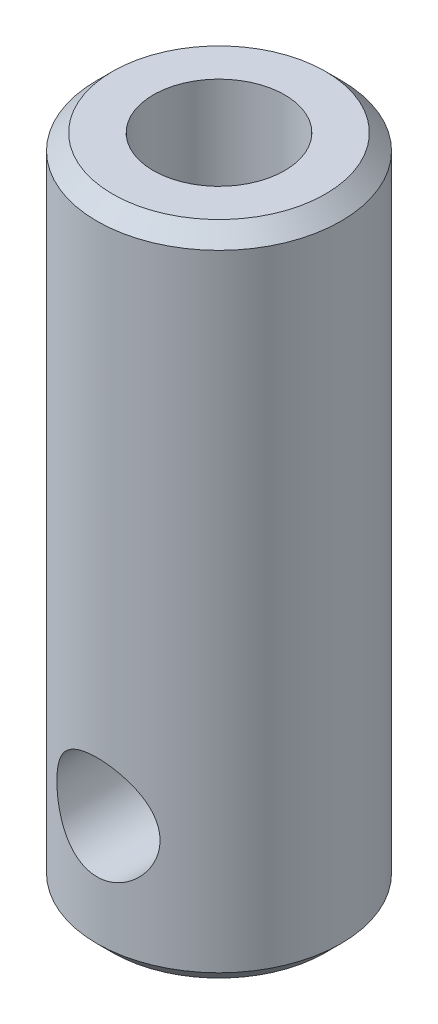
ISO-10303-21;
HEADER;
FILE_DESCRIPTION(('STEP AP214'),'2;1');
FILE_NAME('part.step','',(''),(''),'','','');
FILE_SCHEMA(('AUTOMOTIVE_DESIGN { 1 0 10303 214 1 1 1 1 }'));
ENDSEC;
DATA;
#1=APPLICATION_CONTEXT('core data for automotive mechanical design processes');
#2=APPLICATION_PROTOCOL_DEFINITION('international standard','automotive_design',2000,#1);
#3=PRODUCT_CONTEXT('',#1,'mechanical');
#4=PRODUCT('Part','Part','',(#3));
#5=PRODUCT_RELATED_PRODUCT_CATEGORY('part','',(#4));
#6=PRODUCT_DEFINITION_FORMATION('','',#4);
#7=PRODUCT_DEFINITION_CONTEXT('part definition',#1,'design');
#8=PRODUCT_DEFINITION('design','',#6,#7);
#9=PRODUCT_DEFINITION_SHAPE('','',#8);
#10=(LENGTH_UNIT() NAMED_UNIT(*) SI_UNIT(.MILLI.,.METRE.));
#11=(NAMED_UNIT(*) PLANE_ANGLE_UNIT() SI_UNIT($,.RADIAN.));
#12=(NAMED_UNIT(*) SI_UNIT($,.STERADIAN.) SOLID_ANGLE_UNIT());
#13=UNCERTAINTY_MEASURE_WITH_UNIT(LENGTH_MEASURE(1.E-05),#10,'distance_accuracy_value','');
#14=(GEOMETRIC_REPRESENTATION_CONTEXT(3) GLOBAL_UNCERTAINTY_ASSIGNED_CONTEXT((#13)) GLOBAL_UNIT_ASSIGNED_CONTEXT((#10,
#11,#12)) REPRESENTATION_CONTEXT('',''));
#15=CARTESIAN_POINT('',(0.,0.,0.));
#16=DIRECTION('',(0.,0.,1.));
#17=DIRECTION('',(1.,0.,0.));
#18=AXIS2_PLACEMENT_3D('',#15,#16,#17);
#19=CARTESIAN_POINT('',(0.,21.,0.));
#20=DIRECTION('',(0.,-1.,0.));
#21=DIRECTION('',(0.,0.,-1.));
#22=AXIS2_PLACEMENT_3D('',#19,#20,#21);
#23=CYLINDRICAL_SURFACE('',#22,3.9);
#24=CARTESIAN_POINT('',(0.,0.500000000000025,0.));
#25=DIRECTION('',(0.,1.,0.));
#26=DIRECTION('',(0.,0.,1.));
#27=AXIS2_PLACEMENT_3D('',#24,#25,#26);
#28=CIRCLE('',#27,3.9);
#29=CARTESIAN_POINT('',(0.,0.500000000000025,3.9));
#30=VERTEX_POINT('',#29);
#31=EDGE_CURVE('E100',#30,#30,#28,.T.);
#32=ORIENTED_EDGE('',*,*,#31,.T.);
#33=EDGE_LOOP('',(#32));
#34=FACE_BOUND('',#33,.T.);
#35=CARTESIAN_POINT('',(0.,20.5,0.));
#36=DIRECTION('',(0.,1.,0.));
#37=DIRECTION('',(0.,0.,1.));
#38=AXIS2_PLACEMENT_3D('',#35,#36,#37);
#39=CIRCLE('',#38,3.9);
#40=CARTESIAN_POINT('',(0.,20.5,3.9));
#41=VERTEX_POINT('',#40);
#42=EDGE_CURVE('E104',#41,#41,#39,.F.);
#43=ORIENTED_EDGE('',*,*,#42,.T.);
#44=EDGE_LOOP('',(#43));
#45=FACE_BOUND('',#44,.T.);
#46=CARTESIAN_POINT('',(0.,5.65,-3.9));
#47=CARTESIAN_POINT('',(-0.0882681783908904,5.64999010962298,-3.8999925211674));
#48=CARTESIAN_POINT('',(-0.176669093225601,5.64287520727005,-3.89696883534107));
#49=CARTESIAN_POINT('',(-0.350960127656673,5.61467104283653,-3.88516503793536));
#50=CARTESIAN_POINT('',(-0.436843216712766,5.59354594223812,-3.87637016409038));
#51=CARTESIAN_POINT('',(-0.603289578841337,5.53824649709417,-3.85396772395476));
#52=CARTESIAN_POINT('',(-0.683870000140019,5.50411691370326,-3.84037667770881));
#53=CARTESIAN_POINT('',(-0.838081548821426,5.42396496337108,-3.80969936619053));
#54=CARTESIAN_POINT('',(-0.911714653532988,5.37794599438323,-3.79261409984689));
#55=CARTESIAN_POINT('',(-1.05384788665929,5.27282377072988,-3.75566884554803));
#56=CARTESIAN_POINT('',(-1.1219439884534,5.21320712248442,-3.73571617528166));
#57=CARTESIAN_POINT('',(-1.24752086033202,5.08366821945808,-3.69567914050909));
#58=CARTESIAN_POINT('',(-1.30499587954679,5.01374041824706,-3.67559471071925));
#59=CARTESIAN_POINT('',(-1.41060418048894,4.86123617092446,-3.63641764695952));
#60=CARTESIAN_POINT('',(-1.458110126503,4.7781960137174,-3.61742811712792));
#61=CARTESIAN_POINT('',(-1.53829932247425,4.60438506039958,-3.58406689438791));
#62=CARTESIAN_POINT('',(-1.57099044145061,4.51361839879212,-3.56969275116376));
#63=CARTESIAN_POINT('',(-1.61894043770419,4.33158207667331,-3.54819611613621));
#64=CARTESIAN_POINT('',(-1.63497822296055,4.24055712615464,-3.5407514836763));
#65=CARTESIAN_POINT('',(-1.65159485188688,4.05682719794722,-3.533033741591));
#66=CARTESIAN_POINT('',(-1.65218260534746,3.96412321939803,-3.53275649864621));
#67=CARTESIAN_POINT('',(-1.63846781211355,3.78753856245685,-3.5391330946113));
#68=CARTESIAN_POINT('',(-1.62534536275848,3.70354235730889,-3.54523764929389));
#69=CARTESIAN_POINT('',(-1.58656676180535,3.53908025640973,-3.56275929231149));
#70=CARTESIAN_POINT('',(-1.56090812116471,3.45861506519533,-3.57417743563041));
#71=CARTESIAN_POINT('',(-1.49728208337191,3.30143488644236,-3.60129975238872));
#72=CARTESIAN_POINT('',(-1.45906098080649,3.22483832101664,-3.61709111166557));
#73=CARTESIAN_POINT('',(-1.37157495248506,3.07884206932871,-3.65116178776455));
#74=CARTESIAN_POINT('',(-1.32230559728137,3.00944528595883,-3.66944210129633));
#75=CARTESIAN_POINT('',(-1.20906949760373,2.87343530009855,-3.7083735698788));
#76=CARTESIAN_POINT('',(-1.14419462421828,2.80759532589033,-3.72909230650854));
#77=CARTESIAN_POINT('',(-1.00412543745614,2.68746537079169,-3.76922223153383));
#78=CARTESIAN_POINT('',(-0.928928563537178,2.63317826432908,-3.78863309370274));
#79=CARTESIAN_POINT('',(-0.767938040283636,2.53651281675991,-3.8245559357465));
#80=CARTESIAN_POINT('',(-0.681930137783401,2.49445833978708,-3.84098537018142));
#81=CARTESIAN_POINT('',(-0.503187450848332,2.42568836570901,-3.86845665415791));
#82=CARTESIAN_POINT('',(-0.410456536548707,2.39896412141987,-3.87950157547465));
#83=CARTESIAN_POINT('',(-0.227353881530038,2.363253215025,-3.89438002487267));
#84=CARTESIAN_POINT('',(-0.137218599364963,2.35322944443366,-3.89863444455338));
#85=CARTESIAN_POINT('',(0.0435396124007256,2.34810048249026,-3.90080298725191));
#86=CARTESIAN_POINT('',(0.134162388363567,2.35299083763031,-3.89871900298138));
#87=CARTESIAN_POINT('',(0.308404500461262,2.37681721200701,-3.88871667461654));
#88=CARTESIAN_POINT('',(0.39214413638654,2.39501676493239,-3.88110438723848));
#89=CARTESIAN_POINT('',(0.55528471992451,2.44391085958388,-3.86114196405335));
#90=CARTESIAN_POINT('',(0.634685122281652,2.47460696751496,-3.84879123438403));
#91=CARTESIAN_POINT('',(0.78969064023766,2.54862283787114,-3.82005221405231));
#92=CARTESIAN_POINT('',(0.865100305197604,2.59230626674186,-3.80355006898931));
#93=CARTESIAN_POINT('',(1.00779006461431,2.6906582774137,-3.76825827975809));
#94=CARTESIAN_POINT('',(1.07506670221963,2.74533150419825,-3.74946766966788));
#95=CARTESIAN_POINT('',(1.20478688449879,2.86881272474558,-3.70990837496728));
#96=CARTESIAN_POINT('',(1.26651068966939,2.93836470484917,-3.68909587009275));
#97=CARTESIAN_POINT('',(1.37762070323705,3.08715582505632,-3.64906256282253));
#98=CARTESIAN_POINT('',(1.4270037795701,3.16639741678858,-3.62984216532782));
#99=CARTESIAN_POINT('',(1.51265863842251,3.33414036237878,-3.59500286605268));
#100=CARTESIAN_POINT('',(1.5487052063188,3.42277086068644,-3.57944731008356));
#101=CARTESIAN_POINT('',(1.6050469154919,3.60571095450335,-3.55454508708672));
#102=CARTESIAN_POINT('',(1.62535559006542,3.7000155953346,-3.5451930865094));
#103=CARTESIAN_POINT('',(1.64828060138811,3.88361545500838,-3.53458851098651));
#104=CARTESIAN_POINT('',(1.65216570578641,3.97271934958844,-3.53275544421227));
#105=CARTESIAN_POINT('',(1.64554193353702,4.15026165223544,-3.5358458548624));
#106=CARTESIAN_POINT('',(1.63503543717477,4.23870016791976,-3.54076821497947));
#107=CARTESIAN_POINT('',(1.60100333643302,4.40788417057105,-3.5562773126425));
#108=CARTESIAN_POINT('',(1.5781475520762,4.48879379383711,-3.56657176411084));
#109=CARTESIAN_POINT('',(1.52073195931363,4.64564253160092,-3.59142696267732));
#110=CARTESIAN_POINT('',(1.48616884127019,4.72158023329536,-3.60598891603182));
#111=CARTESIAN_POINT('',(1.40388934471402,4.87140110617054,-3.63884164245072));
#112=CARTESIAN_POINT('',(1.35549795347627,4.94487477175257,-3.65730596648671));
#113=CARTESIAN_POINT('',(1.24786501628541,5.0830555158859,-3.69541470314504));
#114=CARTESIAN_POINT('',(1.18861952349453,5.14775939057108,-3.71505954328235));
#115=CARTESIAN_POINT('',(1.05561473519844,5.27163235594304,-3.75511029414846));
#116=CARTESIAN_POINT('',(0.981094225821295,5.33000604891023,-3.77546042928415));
#117=CARTESIAN_POINT('',(0.822568750497357,5.43346999823247,-3.81313626980711));
#118=CARTESIAN_POINT('',(0.738559502758363,5.47855422432587,-3.83046060074949));
#119=CARTESIAN_POINT('',(0.56463562377867,5.55322487756346,-3.8599024779365));
#120=CARTESIAN_POINT('',(0.474832936913759,5.58304106628023,-3.87209669208508));
#121=CARTESIAN_POINT('',(0.291020245930611,5.62686067402158,-3.89021412824512));
#122=CARTESIAN_POINT('',(0.197024300042908,5.64091332616206,-3.89615687138607));
#123=CARTESIAN_POINT('',(0.0684385645333009,5.64893922719099,-3.89955222665063));
#124=CARTESIAN_POINT('',(0.0342292626435422,5.65000383536082,-3.90000290019495));
#125=CARTESIAN_POINT('',(0.,5.65,-3.9));
#126=B_SPLINE_CURVE_WITH_KNOTS('',3,(#46,#47,#48,#49,#50,#51,#52,#53,#54,#55,#56,#57,#58,#59,
#60,#61,#62,#63,#64,#65,#66,#67,#68,#69,#70,#71,#72,#73,#74,#75,#76,#77,#78,#79,#80,#81,#82,#83,
#84,#85,#86,#87,#88,#89,#90,#91,#92,#93,#94,#95,#96,#97,#98,#99,#100,#101,#102,#103,#104,#105,
#106,#107,#108,#109,#110,#111,#112,#113,#114,#115,#116,#117,#118,#119,#120,#121,#122,#123,#124,
#125),.UNSPECIFIED.,.T.,.F.,(4,2,2,2,2,2,2,2,2,2,2,2,2,2,2,2,2,2,2,2,2,2,2,2,2,2,2,2,2,2,2,2,2,
2,2,2,2,2,2,4),(0.,0.264704885428988,0.530089519370611,0.794568837927257,1.05897265248283,
1.33580610470644,1.61278901420021,1.90392381312241,2.19490379159159,2.47155987625674,
2.74805641420202,3.00257085651553,3.25713585285043,3.51719507960629,3.7773587558925,
4.06025791035948,4.3432273698753,4.63312013162697,4.92284732028875,5.19380162150991,
5.46467502097555,5.72159575636488,5.97854870178935,6.24351112288917,6.50858577023762,
6.79316251778684,7.07781141742997,7.3670687571551,7.65607708243777,7.92229725303884,
8.18847339771807,8.44148081639513,8.69455981949483,8.96311271803481,9.23176346401957,
9.52084957004799,9.81006665128927,10.0947931306725,10.3786278467067,10.4812769917502),.UNSPECIFIED.);
#127=CARTESIAN_POINT('',(0.,5.65,-3.9));
#128=VERTEX_POINT('',#127);
#129=EDGE_CURVE('E62',#128,#128,#126,.T.);
#130=ORIENTED_EDGE('',*,*,#129,.T.);
#131=EDGE_LOOP('',(#130));
#132=FACE_BOUND('',#131,.T.);
#133=CARTESIAN_POINT('',(1.65,4.,3.53376569681692));
#134=CARTESIAN_POINT('',(1.6499897530623,3.91213273586051,3.53377573035558));
#135=CARTESIAN_POINT('',(1.64293673976528,3.82412777637942,3.53709087166657));
#136=CARTESIAN_POINT('',(1.61500105214839,3.65066604429405,3.54992833622334));
#137=CARTESIAN_POINT('',(1.5940813635928,3.56521673322436,3.5594672715351));
#138=CARTESIAN_POINT('',(1.53938119370233,3.39969266420764,3.58346017281877));
#139=CARTESIAN_POINT('',(1.50565424367185,3.31959714557907,3.59789365424824));
#140=CARTESIAN_POINT('',(1.42645435428167,3.16622348365306,3.63002023451877));
#141=CARTESIAN_POINT('',(1.38098394005357,3.09294387936923,3.64771263237895));
#142=CARTESIAN_POINT('',(1.27646749042837,2.95053454234831,3.68563319898024));
#143=CARTESIAN_POINT('',(1.21678511365758,2.88189494502047,3.70594903609465));
#144=CARTESIAN_POINT('',(1.08687424539564,2.75523528284625,3.7461079655175));
#145=CARTESIAN_POINT('',(1.01664163319145,2.69721938714168,3.76595086958331));
#146=CARTESIAN_POINT('',(0.86374760818621,2.59092653542705,3.80399942103802));
#147=CARTESIAN_POINT('',(0.78066934529749,2.54320476334358,3.82209133595915));
#148=CARTESIAN_POINT('',(0.606759837617712,2.46262752716465,3.85352201280363));
#149=CARTESIAN_POINT('',(0.515932158292917,2.42976526966137,3.86686294616613));
#150=CARTESIAN_POINT('',(0.334251686227392,2.38162781096659,3.88666609768683));
#151=CARTESIAN_POINT('',(0.2436597673028,2.36550639984134,3.89345789501178));
#152=CARTESIAN_POINT('',(0.0608192295729573,2.34857020672976,3.90059705420448));
#153=CARTESIAN_POINT('',(-0.0314286789365285,2.34774901202976,3.90094711596829));
#154=CARTESIAN_POINT('',(-0.208795368271683,2.36100129058804,3.89535480279478));
#155=CARTESIAN_POINT('',(-0.293998447286352,2.37414394713837,3.8898056505484));
#156=CARTESIAN_POINT('',(-0.460857119635666,2.4133503215929,3.87358233886758));
#157=CARTESIAN_POINT('',(-0.542512450592235,2.4394149933975,3.86290780108011));
#158=CARTESIAN_POINT('',(-0.701462498503118,2.50403006238907,3.83725635386755));
#159=CARTESIAN_POINT('',(-0.77867144627143,2.54276528249236,3.82221615342426));
#160=CARTESIAN_POINT('',(-0.925696233339136,2.63143734027003,3.78929689058315));
#161=CARTESIAN_POINT('',(-0.995509422013658,2.68137817415284,3.77141681607981));
#162=CARTESIAN_POINT('',(-1.13113022098868,2.79524275599655,3.73307705223418));
#163=CARTESIAN_POINT('',(-1.19628249828967,2.85991679480621,3.71252432146039));
#164=CARTESIAN_POINT('',(-1.315105185137,2.9993048638532,3.67211730247985));
#165=CARTESIAN_POINT('',(-1.36877088567944,3.07402299137828,3.65226330349953));
#166=CARTESIAN_POINT('',(-1.46485385795649,3.23465188987381,3.61482513874697));
#167=CARTESIAN_POINT('',(-1.50681510559583,3.3208615131392,3.59734390662222));
#168=CARTESIAN_POINT('',(-1.5753547818834,3.50005884256828,3.56786570557029));
#169=CARTESIAN_POINT('',(-1.60194460622272,3.5930414697931,3.555864675255));
#170=CARTESIAN_POINT('',(-1.63729182704697,3.77657108633694,3.53972188335749));
#171=CARTESIAN_POINT('',(-1.64711446453695,3.86687095204369,3.53511187881798));
#172=CARTESIAN_POINT('',(-1.65178544530199,4.04792699363365,3.53293306879817));
#173=CARTESIAN_POINT('',(-1.64663924251459,4.13868299129527,3.53536169877112));
#174=CARTESIAN_POINT('',(-1.62249151139539,4.31167161583801,3.54650153196409));
#175=CARTESIAN_POINT('',(-1.60444004295333,4.39406824133358,3.55478151317846));
#176=CARTESIAN_POINT('',(-1.55626363388267,4.55458989996476,3.57613373470828));
#177=CARTESIAN_POINT('',(-1.526135812464,4.63271390881909,3.58920711841689));
#178=CARTESIAN_POINT('',(-1.45322923445869,4.78622827246494,3.61935626648122));
#179=CARTESIAN_POINT('',(-1.4099624442886,4.86135686394307,3.63657988891041));
#180=CARTESIAN_POINT('',(-1.31248658692196,5.00365554297985,3.67288461061371));
#181=CARTESIAN_POINT('',(-1.25827268161533,5.07082209078644,3.69196652923013));
#182=CARTESIAN_POINT('',(-1.13504949312433,5.20119489742077,3.73178152849098));
#183=CARTESIAN_POINT('',(-1.06517748995845,5.26358798113633,3.75251799105616));
#184=CARTESIAN_POINT('',(-0.915481764510231,5.37591744933957,3.79181689790887));
#185=CARTESIAN_POINT('',(-0.835657173958665,5.42585274586096,3.8103791522429));
#186=CARTESIAN_POINT('',(-0.667635507721921,5.51185234426173,3.84338535578829));
#187=CARTESIAN_POINT('',(-0.579407856829679,5.54786337596312,3.85781343542316));
#188=CARTESIAN_POINT('',(-0.397377333675081,5.60426141660654,3.88078402924081));
#189=CARTESIAN_POINT('',(-0.303577932343884,5.62465804482366,3.88933016667416));
#190=CARTESIAN_POINT('',(-0.120322918122858,5.64800975881954,3.89914551068237));
#191=CARTESIAN_POINT('',(-0.0310379080345664,5.65211029132142,3.90089243212818));
#192=CARTESIAN_POINT('',(0.146921325983462,5.64585438933974,3.898246689304));
#193=CARTESIAN_POINT('',(0.235595659900474,5.63550063044606,3.89385516130352));
#194=CARTESIAN_POINT('',(0.406389782414436,5.60145244499653,3.87968100020246));
#195=CARTESIAN_POINT('',(0.488630675515971,5.5782716856892,3.87010623593853));
#196=CARTESIAN_POINT('',(0.64801827121917,5.51979693418484,3.84663071530024));
#197=CARTESIAN_POINT('',(0.725164018749655,5.4845006786119,3.83272915065299));
#198=CARTESIAN_POINT('',(0.8760385836284,5.40100881926648,3.80115336524196));
#199=CARTESIAN_POINT('',(0.949452698240069,5.35229981163911,3.78333638338748));
#200=CARTESIAN_POINT('',(1.08738147408053,5.24410280720797,3.74602657517449));
#201=CARTESIAN_POINT('',(1.15189269432276,5.18461066313747,3.72653310554873));
#202=CARTESIAN_POINT('',(1.27492004811449,5.05159544925452,3.68633405844934));
#203=CARTESIAN_POINT('',(1.33269274146117,4.9773788340428,3.66563993003231));
#204=CARTESIAN_POINT('',(1.43508447817084,4.81967688551886,3.62678143097992));
#205=CARTESIAN_POINT('',(1.47969601803973,4.73618630208249,3.60861850654674));
#206=CARTESIAN_POINT('',(1.55409672247199,4.5623134857922,3.57720792944634));
#207=CARTESIAN_POINT('',(1.58393769812571,4.47195664352197,3.56394313767562));
#208=CARTESIAN_POINT('',(1.62761911598203,4.28692619963196,3.54421433486359));
#209=CARTESIAN_POINT('',(1.6415132261811,4.19226819819914,3.53772751968892));
#210=CARTESIAN_POINT('',(1.64904852546506,4.06483023224746,3.53420835934084));
#211=CARTESIAN_POINT('',(1.65000378129154,4.03242449134199,3.5337619942732));
#212=CARTESIAN_POINT('',(1.65,4.,3.53376569681692));
#213=B_SPLINE_CURVE_WITH_KNOTS('',3,(#133,#134,#135,#136,#137,#138,#139,#140,#141,#142,#143,
#144,#145,#146,#147,#148,#149,#150,#151,#152,#153,#154,#155,#156,#157,#158,#159,#160,#161,#162,
#163,#164,#165,#166,#167,#168,#169,#170,#171,#172,#173,#174,#175,#176,#177,#178,#179,#180,#181,
#182,#183,#184,#185,#186,#187,#188,#189,#190,#191,#192,#193,#194,#195,#196,#197,#198,#199,#200,
#201,#202,#203,#204,#205,#206,#207,#208,#209,#210,#211,#212),.UNSPECIFIED.,.T.,.F.,(4,2,2,2,2,2,
2,2,2,2,2,2,2,2,2,2,2,2,2,2,2,2,2,2,2,2,2,2,2,2,2,2,2,2,2,2,2,2,2,4),(0.,0.263506611411638,
0.52771944732339,0.790839879988544,1.05390378237129,1.33228624471245,1.61077772180738,
1.90179106529495,2.19267122972663,2.46800248446359,2.74321833820299,3.0011753785028,
3.25915146397208,3.5210722174553,3.78308652745956,4.06405925722561,4.3451469540718,
4.63600876291468,4.92665466227284,5.19803415827186,5.46931478880279,5.72244476399108,
5.97563515880371,6.23970644179638,6.50389468832541,6.79038862857686,7.07690758022993,
7.36451207341254,7.65193924454567,7.91876293727843,8.18553724563801,8.44232958610773,
8.69916992578427,8.967684720172,9.23630300714125,9.52386154781882,9.81158371719626,
10.0982893545579,10.3840272496344,10.4812656002755),.UNSPECIFIED.);
#214=CARTESIAN_POINT('',(1.65,4.,3.53376569681692));
#215=VERTEX_POINT('',#214);
#216=EDGE_CURVE('E58',#215,#215,#213,.T.);
#217=ORIENTED_EDGE('',*,*,#216,.T.);
#218=EDGE_LOOP('',(#217));
#219=FACE_BOUND('',#218,.T.);
#220=ADVANCED_FACE('F38',(#34,#45,#132,#219),#23,.T.);
#221=CARTESIAN_POINT('',(0.,21.,0.));
#222=DIRECTION('',(0.,1.,0.));
#223=DIRECTION('',(0.,0.,1.));
#224=AXIS2_PLACEMENT_3D('',#221,#222,#223);
#225=PLANE('',#224);
#226=CARTESIAN_POINT('',(0.,21.,0.));
#227=DIRECTION('',(0.,1.,0.));
#228=DIRECTION('',(0.,0.,1.));
#229=AXIS2_PLACEMENT_3D('',#226,#227,#228);
#230=CIRCLE('',#229,3.40000000000001);
#231=CARTESIAN_POINT('',(0.,21.,3.40000000000001));
#232=VERTEX_POINT('',#231);
#233=EDGE_CURVE('E11',#232,#232,#230,.T.);
#234=ORIENTED_EDGE('',*,*,#233,.T.);
#235=EDGE_LOOP('',(#234));
#236=FACE_BOUND('',#235,.T.);
#237=CARTESIAN_POINT('',(0.,21.,0.));
#238=DIRECTION('',(0.,1.,0.));
#239=DIRECTION('',(0.,0.,1.));
#240=AXIS2_PLACEMENT_3D('',#237,#238,#239);
#241=CIRCLE('',#240,2.1);
#242=CARTESIAN_POINT('',(0.,21.,2.1));
#243=VERTEX_POINT('',#242);
#244=EDGE_CURVE('E59',#243,#243,#241,.T.);
#245=ORIENTED_EDGE('',*,*,#244,.F.);
#246=EDGE_LOOP('',(#245));
#247=FACE_BOUND('',#246,.T.);
#248=ADVANCED_FACE('F84',(#236,#247),#225,.T.);
#249=CARTESIAN_POINT('',(0.,0.,0.));
#250=DIRECTION('',(0.,1.,0.));
#251=DIRECTION('',(0.,0.,1.));
#252=AXIS2_PLACEMENT_3D('',#249,#250,#251);
#253=PLANE('',#252);
#254=CARTESIAN_POINT('',(0.,0.,0.));
#255=DIRECTION('',(0.,1.,0.));
#256=DIRECTION('',(0.,0.,1.));
#257=AXIS2_PLACEMENT_3D('',#254,#255,#256);
#258=CIRCLE('',#257,3.39999999999998);
#259=CARTESIAN_POINT('',(0.,0.,3.39999999999998));
#260=VERTEX_POINT('',#259);
#261=EDGE_CURVE('E45',#260,#260,#258,.F.);
#262=ORIENTED_EDGE('',*,*,#261,.T.);
#263=EDGE_LOOP('',(#262));
#264=FACE_BOUND('',#263,.T.);
#265=ADVANCED_FACE('F81',(#264),#253,.F.);
#266=CARTESIAN_POINT('',(0.,4.,3.9));
#267=DIRECTION('',(0.,0.,1.));
#268=DIRECTION('',(1.,0.,0.));
#269=AXIS2_PLACEMENT_3D('',#266,#267,#268);
#270=CYLINDRICAL_SURFACE('',#269,1.65);
#271=ORIENTED_EDGE('',*,*,#216,.F.);
#272=EDGE_LOOP('',(#271));
#273=FACE_BOUND('',#272,.T.);
#274=ORIENTED_EDGE('',*,*,#129,.F.);
#275=EDGE_LOOP('',(#274));
#276=FACE_BOUND('',#275,.T.);
#277=ADVANCED_FACE('F52',(#273,#276),#270,.F.);
#278=CARTESIAN_POINT('',(0.,9.,0.));
#279=DIRECTION('',(0.,1.,0.));
#280=DIRECTION('',(0.,0.,1.));
#281=AXIS2_PLACEMENT_3D('',#278,#279,#280);
#282=CONICAL_SURFACE('',#281,2.1,1.02974425867665);
#283=CARTESIAN_POINT('',(0.,7.73819270004212,0.));
#284=VERTEX_POINT('',#283);
#285=VERTEX_LOOP('',#284);
#286=FACE_BOUND('',#285,.T.);
#287=CARTESIAN_POINT('',(0.,9.,0.));
#288=DIRECTION('',(0.,1.,0.));
#289=DIRECTION('',(0.,0.,1.));
#290=AXIS2_PLACEMENT_3D('',#287,#288,#289);
#291=CIRCLE('',#290,2.1);
#292=CARTESIAN_POINT('',(0.,9.,2.1));
#293=VERTEX_POINT('',#292);
#294=EDGE_CURVE('E56',#293,#293,#291,.T.);
#295=ORIENTED_EDGE('',*,*,#294,.T.);
#296=EDGE_LOOP('',(#295));
#297=FACE_BOUND('',#296,.T.);
#298=ADVANCED_FACE('F48',(#286,#297),#282,.F.);
#299=CARTESIAN_POINT('',(0.,21.,0.));
#300=DIRECTION('',(0.,1.,0.));
#301=DIRECTION('',(0.,0.,1.));
#302=AXIS2_PLACEMENT_3D('',#299,#300,#301);
#303=CYLINDRICAL_SURFACE('',#302,2.1);
#304=ORIENTED_EDGE('',*,*,#294,.F.);
#305=EDGE_LOOP('',(#304));
#306=FACE_BOUND('',#305,.T.);
#307=ORIENTED_EDGE('',*,*,#244,.T.);
#308=EDGE_LOOP('',(#307));
#309=FACE_BOUND('',#308,.T.);
#310=ADVANCED_FACE('F51',(#306,#309),#303,.F.);
#311=CARTESIAN_POINT('',(0.,0.500000000000025,0.));
#312=DIRECTION('',(0.,1.,0.));
#313=DIRECTION('',(0.,0.,1.));
#314=AXIS2_PLACEMENT_3D('',#311,#312,#313);
#315=CONICAL_SURFACE('',#314,3.9,0.785398163397447);
#316=ORIENTED_EDGE('',*,*,#261,.F.);
#317=EDGE_LOOP('',(#316));
#318=FACE_BOUND('',#317,.T.);
#319=ORIENTED_EDGE('',*,*,#31,.F.);
#320=EDGE_LOOP('',(#319));
#321=FACE_BOUND('',#320,.T.);
#322=ADVANCED_FACE('F113',(#318,#321),#315,.T.);
#323=CARTESIAN_POINT('',(0.,21.,0.));
#324=DIRECTION('',(0.,-1.,0.));
#325=DIRECTION('',(0.,0.,-1.));
#326=AXIS2_PLACEMENT_3D('',#323,#324,#325);
#327=CONICAL_SURFACE('',#326,3.40000000000001,0.785398163397445);
#328=ORIENTED_EDGE('',*,*,#42,.F.);
#329=EDGE_LOOP('',(#328));
#330=FACE_BOUND('',#329,.T.);
#331=ORIENTED_EDGE('',*,*,#233,.F.);
#332=EDGE_LOOP('',(#331));
#333=FACE_BOUND('',#332,.T.);
#334=ADVANCED_FACE('F40',(#330,#333),#327,.T.);
#335=CLOSED_SHELL('',(#220,#248,#265,#277,#298,#310,#322,#334));
#336=MANIFOLD_SOLID_BREP('B2',#335);
#337=ADVANCED_BREP_SHAPE_REPRESENTATION('',(#18,#336),#14);
#338=SHAPE_DEFINITION_REPRESENTATION(#9,#337);
ENDSEC;
END-ISO-10303-21;
